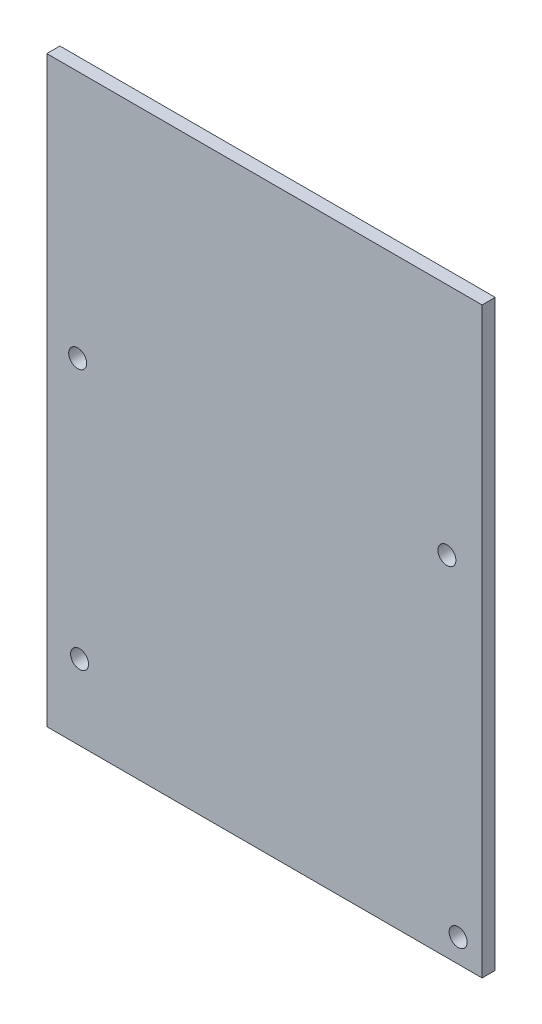
ISO-10303-21;
HEADER;
FILE_DESCRIPTION(('STEP AP214'),'2;1');
FILE_NAME('part.step','',(''),(''),'','','');
FILE_SCHEMA(('AUTOMOTIVE_DESIGN { 1 0 10303 214 1 1 1 1 }'));
ENDSEC;
DATA;
#1=APPLICATION_CONTEXT('core data for automotive mechanical design processes');
#2=APPLICATION_PROTOCOL_DEFINITION('international standard','automotive_design',2000,#1);
#3=PRODUCT_CONTEXT('',#1,'mechanical');
#4=PRODUCT('Part','Part','',(#3));
#5=PRODUCT_RELATED_PRODUCT_CATEGORY('part','',(#4));
#6=PRODUCT_DEFINITION_FORMATION('','',#4);
#7=PRODUCT_DEFINITION_CONTEXT('part definition',#1,'design');
#8=PRODUCT_DEFINITION('design','',#6,#7);
#9=PRODUCT_DEFINITION_SHAPE('','',#8);
#10=(LENGTH_UNIT() NAMED_UNIT(*) SI_UNIT(.MILLI.,.METRE.));
#11=(NAMED_UNIT(*) PLANE_ANGLE_UNIT() SI_UNIT($,.RADIAN.));
#12=(NAMED_UNIT(*) SI_UNIT($,.STERADIAN.) SOLID_ANGLE_UNIT());
#13=UNCERTAINTY_MEASURE_WITH_UNIT(LENGTH_MEASURE(1.E-05),#10,'distance_accuracy_value','');
#14=(GEOMETRIC_REPRESENTATION_CONTEXT(3) GLOBAL_UNCERTAINTY_ASSIGNED_CONTEXT((#13)) GLOBAL_UNIT_ASSIGNED_CONTEXT((#10,
#11,#12)) REPRESENTATION_CONTEXT('',''));
#15=CARTESIAN_POINT('',(0.,0.,0.));
#16=DIRECTION('',(0.,0.,1.));
#17=DIRECTION('',(1.,0.,0.));
#18=AXIS2_PLACEMENT_3D('',#15,#16,#17);
#19=CARTESIAN_POINT('',(-29.5,40.5,1.778));
#20=DIRECTION('',(1.,0.,0.));
#21=DIRECTION('',(0.,1.,0.));
#22=AXIS2_PLACEMENT_3D('',#19,#20,#21);
#23=PLANE('',#22);
#24=DIRECTION('',(0.,-1.,0.));
#25=VECTOR('',#24,1.);
#26=CARTESIAN_POINT('',(-29.5,40.5,0.));
#27=LINE('',#26,#25);
#28=CARTESIAN_POINT('',(-29.5,40.5,0.));
#29=VERTEX_POINT('',#28);
#30=CARTESIAN_POINT('',(-29.5,-38.5,0.));
#31=VERTEX_POINT('',#30);
#32=EDGE_CURVE('E80',#29,#31,#27,.T.);
#33=ORIENTED_EDGE('',*,*,#32,.T.);
#34=DIRECTION('',(0.,0.,-1.));
#35=VECTOR('',#34,1.);
#36=CARTESIAN_POINT('',(-29.5,-38.5,1.778));
#37=LINE('',#36,#35);
#38=CARTESIAN_POINT('',(-29.5,-38.5,1.778));
#39=VERTEX_POINT('',#38);
#40=EDGE_CURVE('E11',#39,#31,#37,.T.);
#41=ORIENTED_EDGE('',*,*,#40,.F.);
#42=DIRECTION('',(0.,-1.,0.));
#43=VECTOR('',#42,1.);
#44=CARTESIAN_POINT('',(-29.5,40.5,1.778));
#45=LINE('',#44,#43);
#46=CARTESIAN_POINT('',(-29.5,40.5,1.778));
#47=VERTEX_POINT('',#46);
#48=EDGE_CURVE('E104',#47,#39,#45,.T.);
#49=ORIENTED_EDGE('',*,*,#48,.F.);
#50=DIRECTION('',(0.,0.,-1.));
#51=VECTOR('',#50,1.);
#52=CARTESIAN_POINT('',(-29.5,40.5,1.778));
#53=LINE('',#52,#51);
#54=EDGE_CURVE('E92',#47,#29,#53,.T.);
#55=ORIENTED_EDGE('',*,*,#54,.T.);
#56=EDGE_LOOP('',(#33,#41,#49,#55));
#57=FACE_BOUND('',#56,.T.);
#58=ADVANCED_FACE('F34',(#57),#23,.F.);
#59=CARTESIAN_POINT('',(-29.5,-38.5,1.778));
#60=DIRECTION('',(0.,1.,0.));
#61=DIRECTION('',(0.,0.,1.));
#62=AXIS2_PLACEMENT_3D('',#59,#60,#61);
#63=PLANE('',#62);
#64=DIRECTION('',(1.,0.,0.));
#65=VECTOR('',#64,1.);
#66=CARTESIAN_POINT('',(-29.5,-38.5,0.));
#67=LINE('',#66,#65);
#68=CARTESIAN_POINT('',(29.5,-38.5,0.));
#69=VERTEX_POINT('',#68);
#70=EDGE_CURVE('E76',#31,#69,#67,.T.);
#71=ORIENTED_EDGE('',*,*,#70,.T.);
#72=DIRECTION('',(0.,0.,-1.));
#73=VECTOR('',#72,1.);
#74=CARTESIAN_POINT('',(29.5,-38.5,1.778));
#75=LINE('',#74,#73);
#76=CARTESIAN_POINT('',(29.5,-38.5,1.778));
#77=VERTEX_POINT('',#76);
#78=EDGE_CURVE('E42',#77,#69,#75,.T.);
#79=ORIENTED_EDGE('',*,*,#78,.F.);
#80=DIRECTION('',(1.,0.,0.));
#81=VECTOR('',#80,1.);
#82=CARTESIAN_POINT('',(-29.5,-38.5,1.778));
#83=LINE('',#82,#81);
#84=EDGE_CURVE('E88',#39,#77,#83,.T.);
#85=ORIENTED_EDGE('',*,*,#84,.F.);
#86=ORIENTED_EDGE('',*,*,#40,.T.);
#87=EDGE_LOOP('',(#71,#79,#85,#86));
#88=FACE_BOUND('',#87,.T.);
#89=ADVANCED_FACE('F87',(#88),#63,.F.);
#90=CARTESIAN_POINT('',(29.5,40.5,1.778));
#91=DIRECTION('',(-1.,0.,0.));
#92=DIRECTION('',(0.,-1.,0.));
#93=AXIS2_PLACEMENT_3D('',#90,#91,#92);
#94=PLANE('',#93);
#95=DIRECTION('',(0.,1.,0.));
#96=VECTOR('',#95,1.);
#97=CARTESIAN_POINT('',(29.5,40.5,0.));
#98=LINE('',#97,#96);
#99=CARTESIAN_POINT('',(29.5,40.5,0.));
#100=VERTEX_POINT('',#99);
#101=EDGE_CURVE('E81',#69,#100,#98,.T.);
#102=ORIENTED_EDGE('',*,*,#101,.T.);
#103=DIRECTION('',(0.,0.,-1.));
#104=VECTOR('',#103,1.);
#105=CARTESIAN_POINT('',(29.5,40.5,1.778));
#106=LINE('',#105,#104);
#107=CARTESIAN_POINT('',(29.5,40.5,1.778));
#108=VERTEX_POINT('',#107);
#109=EDGE_CURVE('E110',#108,#100,#106,.T.);
#110=ORIENTED_EDGE('',*,*,#109,.F.);
#111=DIRECTION('',(0.,1.,0.));
#112=VECTOR('',#111,1.);
#113=CARTESIAN_POINT('',(29.5,40.5,1.778));
#114=LINE('',#113,#112);
#115=EDGE_CURVE('E55',#77,#108,#114,.T.);
#116=ORIENTED_EDGE('',*,*,#115,.F.);
#117=ORIENTED_EDGE('',*,*,#78,.T.);
#118=EDGE_LOOP('',(#102,#110,#116,#117));
#119=FACE_BOUND('',#118,.T.);
#120=ADVANCED_FACE('F147',(#119),#94,.F.);
#121=CARTESIAN_POINT('',(-29.5,40.5,1.778));
#122=DIRECTION('',(0.,-1.,0.));
#123=DIRECTION('',(0.,0.,-1.));
#124=AXIS2_PLACEMENT_3D('',#121,#122,#123);
#125=PLANE('',#124);
#126=DIRECTION('',(-1.,0.,0.));
#127=VECTOR('',#126,1.);
#128=CARTESIAN_POINT('',(-29.5,40.5,0.));
#129=LINE('',#128,#127);
#130=EDGE_CURVE('E102',#100,#29,#129,.T.);
#131=ORIENTED_EDGE('',*,*,#130,.T.);
#132=ORIENTED_EDGE('',*,*,#54,.F.);
#133=DIRECTION('',(-1.,0.,0.));
#134=VECTOR('',#133,1.);
#135=CARTESIAN_POINT('',(-29.5,40.5,1.778));
#136=LINE('',#135,#134);
#137=EDGE_CURVE('E50',#108,#47,#136,.T.);
#138=ORIENTED_EDGE('',*,*,#137,.F.);
#139=ORIENTED_EDGE('',*,*,#109,.T.);
#140=EDGE_LOOP('',(#131,#132,#138,#139));
#141=FACE_BOUND('',#140,.T.);
#142=ADVANCED_FACE('F139',(#141),#125,.F.);
#143=CARTESIAN_POINT('',(-29.5,-38.5,1.778));
#144=DIRECTION('',(0.,0.,1.));
#145=DIRECTION('',(1.,0.,0.));
#146=AXIS2_PLACEMENT_3D('',#143,#144,#145);
#147=PLANE('',#146);
#148=CARTESIAN_POINT('',(-25.055,-28.34,1.778));
#149=DIRECTION('',(0.,0.,1.));
#150=DIRECTION('',(1.,0.,0.));
#151=AXIS2_PLACEMENT_3D('',#148,#149,#150);
#152=CIRCLE('',#151,1.2192);
#153=CARTESIAN_POINT('',(-23.8358,-28.34,1.778));
#154=VERTEX_POINT('',#153);
#155=EDGE_CURVE('E128',#154,#154,#152,.T.);
#156=ORIENTED_EDGE('',*,*,#155,.F.);
#157=EDGE_LOOP('',(#156));
#158=FACE_BOUND('',#157,.T.);
#159=CARTESIAN_POINT('',(-25.309,6.839,1.778));
#160=DIRECTION('',(0.,0.,1.));
#161=DIRECTION('',(1.,0.,0.));
#162=AXIS2_PLACEMENT_3D('',#159,#160,#161);
#163=CIRCLE('',#162,1.2192);
#164=CARTESIAN_POINT('',(-24.0898,6.839,1.778));
#165=VERTEX_POINT('',#164);
#166=EDGE_CURVE('E119',#165,#165,#163,.T.);
#167=ORIENTED_EDGE('',*,*,#166,.F.);
#168=EDGE_LOOP('',(#167));
#169=FACE_BOUND('',#168,.T.);
#170=CARTESIAN_POINT('',(24.729,8.744,1.778));
#171=DIRECTION('',(0.,0.,1.));
#172=DIRECTION('',(1.,0.,0.));
#173=AXIS2_PLACEMENT_3D('',#170,#171,#172);
#174=CIRCLE('',#173,1.2192);
#175=CARTESIAN_POINT('',(25.9482,8.744,1.778));
#176=VERTEX_POINT('',#175);
#177=EDGE_CURVE('E116',#176,#176,#174,.T.);
#178=ORIENTED_EDGE('',*,*,#177,.F.);
#179=EDGE_LOOP('',(#178));
#180=FACE_BOUND('',#179,.T.);
#181=CARTESIAN_POINT('',(26.253,-35.325,1.778));
#182=DIRECTION('',(0.,0.,1.));
#183=DIRECTION('',(1.,0.,0.));
#184=AXIS2_PLACEMENT_3D('',#181,#182,#183);
#185=CIRCLE('',#184,1.2192);
#186=CARTESIAN_POINT('',(27.4722,-35.325,1.778));
#187=VERTEX_POINT('',#186);
#188=EDGE_CURVE('E96',#187,#187,#185,.T.);
#189=ORIENTED_EDGE('',*,*,#188,.F.);
#190=EDGE_LOOP('',(#189));
#191=FACE_BOUND('',#190,.T.);
#192=ORIENTED_EDGE('',*,*,#48,.T.);
#193=ORIENTED_EDGE('',*,*,#84,.T.);
#194=ORIENTED_EDGE('',*,*,#115,.T.);
#195=ORIENTED_EDGE('',*,*,#137,.T.);
#196=EDGE_LOOP('',(#192,#193,#194,#195));
#197=FACE_BOUND('',#196,.T.);
#198=ADVANCED_FACE('F136',(#158,#169,#180,#191,#197),#147,.T.);
#199=CARTESIAN_POINT('',(-29.5,-38.5,0.));
#200=DIRECTION('',(0.,0.,1.));
#201=DIRECTION('',(1.,0.,0.));
#202=AXIS2_PLACEMENT_3D('',#199,#200,#201);
#203=PLANE('',#202);
#204=CARTESIAN_POINT('',(-25.055,-28.34,0.));
#205=DIRECTION('',(0.,0.,1.));
#206=DIRECTION('',(1.,0.,0.));
#207=AXIS2_PLACEMENT_3D('',#204,#205,#206);
#208=CIRCLE('',#207,1.2192);
#209=CARTESIAN_POINT('',(-23.8358,-28.34,0.));
#210=VERTEX_POINT('',#209);
#211=EDGE_CURVE('E37',#210,#210,#208,.T.);
#212=ORIENTED_EDGE('',*,*,#211,.T.);
#213=EDGE_LOOP('',(#212));
#214=FACE_BOUND('',#213,.T.);
#215=CARTESIAN_POINT('',(-25.309,6.839,0.));
#216=DIRECTION('',(0.,0.,1.));
#217=DIRECTION('',(1.,0.,0.));
#218=AXIS2_PLACEMENT_3D('',#215,#216,#217);
#219=CIRCLE('',#218,1.2192);
#220=CARTESIAN_POINT('',(-24.0898,6.839,0.));
#221=VERTEX_POINT('',#220);
#222=EDGE_CURVE('E117',#221,#221,#219,.T.);
#223=ORIENTED_EDGE('',*,*,#222,.T.);
#224=EDGE_LOOP('',(#223));
#225=FACE_BOUND('',#224,.T.);
#226=CARTESIAN_POINT('',(24.729,8.744,0.));
#227=DIRECTION('',(0.,0.,1.));
#228=DIRECTION('',(1.,0.,0.));
#229=AXIS2_PLACEMENT_3D('',#226,#227,#228);
#230=CIRCLE('',#229,1.2192);
#231=CARTESIAN_POINT('',(25.9482,8.744,0.));
#232=VERTEX_POINT('',#231);
#233=EDGE_CURVE('E114',#232,#232,#230,.T.);
#234=ORIENTED_EDGE('',*,*,#233,.T.);
#235=EDGE_LOOP('',(#234));
#236=FACE_BOUND('',#235,.T.);
#237=CARTESIAN_POINT('',(26.253,-35.325,0.));
#238=DIRECTION('',(0.,0.,1.));
#239=DIRECTION('',(1.,0.,0.));
#240=AXIS2_PLACEMENT_3D('',#237,#238,#239);
#241=CIRCLE('',#240,1.2192);
#242=CARTESIAN_POINT('',(27.4722,-35.325,0.));
#243=VERTEX_POINT('',#242);
#244=EDGE_CURVE('E93',#243,#243,#241,.T.);
#245=ORIENTED_EDGE('',*,*,#244,.T.);
#246=EDGE_LOOP('',(#245));
#247=FACE_BOUND('',#246,.T.);
#248=ORIENTED_EDGE('',*,*,#32,.F.);
#249=ORIENTED_EDGE('',*,*,#130,.F.);
#250=ORIENTED_EDGE('',*,*,#101,.F.);
#251=ORIENTED_EDGE('',*,*,#70,.F.);
#252=EDGE_LOOP('',(#248,#249,#250,#251));
#253=FACE_BOUND('',#252,.T.);
#254=ADVANCED_FACE('F77',(#214,#225,#236,#247,#253),#203,.F.);
#255=CARTESIAN_POINT('',(26.253,-35.325,1.778));
#256=DIRECTION('',(0.,0.,1.));
#257=DIRECTION('',(1.,0.,0.));
#258=AXIS2_PLACEMENT_3D('',#255,#256,#257);
#259=CYLINDRICAL_SURFACE('',#258,1.2192);
#260=ORIENTED_EDGE('',*,*,#188,.T.);
#261=EDGE_LOOP('',(#260));
#262=FACE_BOUND('',#261,.T.);
#263=ORIENTED_EDGE('',*,*,#244,.F.);
#264=EDGE_LOOP('',(#263));
#265=FACE_BOUND('',#264,.T.);
#266=ADVANCED_FACE('F184',(#262,#265),#259,.F.);
#267=CARTESIAN_POINT('',(24.729,8.744,1.778));
#268=DIRECTION('',(0.,0.,1.));
#269=DIRECTION('',(1.,0.,0.));
#270=AXIS2_PLACEMENT_3D('',#267,#268,#269);
#271=CYLINDRICAL_SURFACE('',#270,1.2192);
#272=ORIENTED_EDGE('',*,*,#177,.T.);
#273=EDGE_LOOP('',(#272));
#274=FACE_BOUND('',#273,.T.);
#275=ORIENTED_EDGE('',*,*,#233,.F.);
#276=EDGE_LOOP('',(#275));
#277=FACE_BOUND('',#276,.T.);
#278=ADVANCED_FACE('F194',(#274,#277),#271,.F.);
#279=CARTESIAN_POINT('',(-25.309,6.839,1.778));
#280=DIRECTION('',(0.,0.,1.));
#281=DIRECTION('',(1.,0.,0.));
#282=AXIS2_PLACEMENT_3D('',#279,#280,#281);
#283=CYLINDRICAL_SURFACE('',#282,1.2192);
#284=ORIENTED_EDGE('',*,*,#166,.T.);
#285=EDGE_LOOP('',(#284));
#286=FACE_BOUND('',#285,.T.);
#287=ORIENTED_EDGE('',*,*,#222,.F.);
#288=EDGE_LOOP('',(#287));
#289=FACE_BOUND('',#288,.T.);
#290=ADVANCED_FACE('F204',(#286,#289),#283,.F.);
#291=CARTESIAN_POINT('',(-25.055,-28.34,1.778));
#292=DIRECTION('',(0.,0.,1.));
#293=DIRECTION('',(1.,0.,0.));
#294=AXIS2_PLACEMENT_3D('',#291,#292,#293);
#295=CYLINDRICAL_SURFACE('',#294,1.2192);
#296=ORIENTED_EDGE('',*,*,#155,.T.);
#297=EDGE_LOOP('',(#296));
#298=FACE_BOUND('',#297,.T.);
#299=ORIENTED_EDGE('',*,*,#211,.F.);
#300=EDGE_LOOP('',(#299));
#301=FACE_BOUND('',#300,.T.);
#302=ADVANCED_FACE('F133',(#298,#301),#295,.F.);
#303=CLOSED_SHELL('',(#58,#89,#120,#142,#198,#254,#266,#278,#290,#302));
#304=MANIFOLD_SOLID_BREP('B2',#303);
#305=ADVANCED_BREP_SHAPE_REPRESENTATION('',(#18,#304),#14);
#306=SHAPE_DEFINITION_REPRESENTATION(#9,#305);
ENDSEC;
END-ISO-10303-21;
